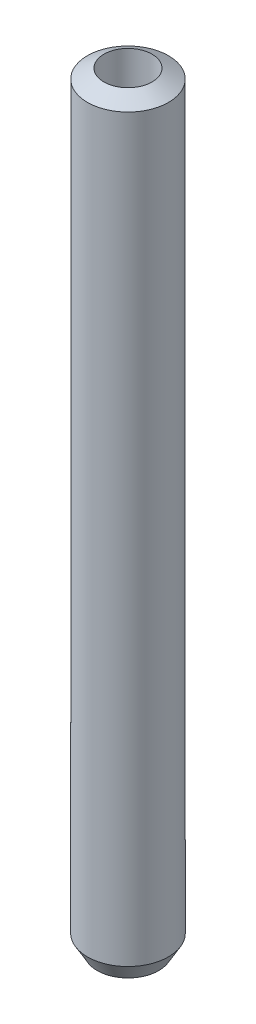
ISO-10303-21;
HEADER;
FILE_DESCRIPTION(('STEP AP214'),'2;1');
FILE_NAME('part.step','',(''),(''),'','','');
FILE_SCHEMA(('AUTOMOTIVE_DESIGN { 1 0 10303 214 1 1 1 1 }'));
ENDSEC;
DATA;
#1=APPLICATION_CONTEXT('core data for automotive mechanical design processes');
#2=APPLICATION_PROTOCOL_DEFINITION('international standard','automotive_design',2000,#1);
#3=PRODUCT_CONTEXT('',#1,'mechanical');
#4=PRODUCT('Part','Part','',(#3));
#5=PRODUCT_RELATED_PRODUCT_CATEGORY('part','',(#4));
#6=PRODUCT_DEFINITION_FORMATION('','',#4);
#7=PRODUCT_DEFINITION_CONTEXT('part definition',#1,'design');
#8=PRODUCT_DEFINITION('design','',#6,#7);
#9=PRODUCT_DEFINITION_SHAPE('','',#8);
#10=(LENGTH_UNIT() NAMED_UNIT(*) SI_UNIT(.MILLI.,.METRE.));
#11=(NAMED_UNIT(*) PLANE_ANGLE_UNIT() SI_UNIT($,.RADIAN.));
#12=(NAMED_UNIT(*) SI_UNIT($,.STERADIAN.) SOLID_ANGLE_UNIT());
#13=UNCERTAINTY_MEASURE_WITH_UNIT(LENGTH_MEASURE(1.E-05),#10,'distance_accuracy_value','');
#14=(GEOMETRIC_REPRESENTATION_CONTEXT(3) GLOBAL_UNCERTAINTY_ASSIGNED_CONTEXT((#13)) GLOBAL_UNIT_ASSIGNED_CONTEXT((#10,
#11,#12)) REPRESENTATION_CONTEXT('',''));
#15=CARTESIAN_POINT('',(0.,0.,0.));
#16=DIRECTION('',(0.,0.,1.));
#17=DIRECTION('',(1.,0.,0.));
#18=AXIS2_PLACEMENT_3D('',#15,#16,#17);
#19=CARTESIAN_POINT('',(0.,141.884383848378,0.));
#20=DIRECTION('',(0.,-1.,0.));
#21=DIRECTION('',(0.,0.,-1.));
#22=AXIS2_PLACEMENT_3D('',#19,#20,#21);
#23=CYLINDRICAL_SURFACE('',#22,7.5);
#24=CARTESIAN_POINT('',(0.,140.093482967697,0.));
#25=DIRECTION('',(0.,1.,0.));
#26=DIRECTION('',(0.,0.,1.));
#27=AXIS2_PLACEMENT_3D('',#24,#25,#26);
#28=CIRCLE('',#27,7.5);
#29=CARTESIAN_POINT('',(0.,140.093482967697,7.5));
#30=VERTEX_POINT('',#29);
#31=EDGE_CURVE('E50',#30,#30,#28,.F.);
#32=ORIENTED_EDGE('',*,*,#31,.T.);
#33=EDGE_LOOP('',(#32));
#34=FACE_BOUND('',#33,.T.);
#35=CARTESIAN_POINT('',(0.,3.1019313166589,0.));
#36=DIRECTION('',(0.,1.,0.));
#37=DIRECTION('',(0.,0.,1.));
#38=AXIS2_PLACEMENT_3D('',#35,#36,#37);
#39=CIRCLE('',#38,7.5);
#40=CARTESIAN_POINT('',(0.,3.1019313166589,7.5));
#41=VERTEX_POINT('',#40);
#42=EDGE_CURVE('E51',#41,#41,#39,.T.);
#43=ORIENTED_EDGE('',*,*,#42,.T.);
#44=EDGE_LOOP('',(#43));
#45=FACE_BOUND('',#44,.T.);
#46=ADVANCED_FACE('F39',(#34,#45),#23,.T.);
#47=CARTESIAN_POINT('',(0.,0.,0.));
#48=DIRECTION('',(0.,1.,0.));
#49=DIRECTION('',(0.,0.,1.));
#50=AXIS2_PLACEMENT_3D('',#47,#48,#49);
#51=PLANE('',#50);
#52=CARTESIAN_POINT('',(0.,0.,0.));
#53=DIRECTION('',(0.,1.,0.));
#54=DIRECTION('',(0.,0.,1.));
#55=AXIS2_PLACEMENT_3D('',#52,#53,#54);
#56=CIRCLE('',#55,5.70909911931923);
#57=CARTESIAN_POINT('',(0.,0.,5.70909911931923));
#58=VERTEX_POINT('',#57);
#59=EDGE_CURVE('E10',#58,#58,#56,.F.);
#60=ORIENTED_EDGE('',*,*,#59,.T.);
#61=EDGE_LOOP('',(#60));
#62=FACE_BOUND('',#61,.T.);
#63=CARTESIAN_POINT('',(0.,0.,0.));
#64=DIRECTION('',(0.,1.,0.));
#65=DIRECTION('',(0.,0.,1.));
#66=AXIS2_PLACEMENT_3D('',#63,#64,#65);
#67=CIRCLE('',#66,4.45957948400407);
#68=CARTESIAN_POINT('',(0.,0.,4.45957948400407));
#69=VERTEX_POINT('',#68);
#70=EDGE_CURVE('E58',#69,#69,#67,.T.);
#71=ORIENTED_EDGE('',*,*,#70,.T.);
#72=EDGE_LOOP('',(#71));
#73=FACE_BOUND('',#72,.T.);
#74=ADVANCED_FACE('F62',(#62,#73),#51,.F.);
#75=CARTESIAN_POINT('',(0.,141.884383848378,0.));
#76=DIRECTION('',(0.,-1.,0.));
#77=DIRECTION('',(0.,0.,-1.));
#78=AXIS2_PLACEMENT_3D('',#75,#76,#77);
#79=CYLINDRICAL_SURFACE('',#78,4.45957948400407);
#80=CARTESIAN_POINT('',(0.,141.848870571057,0.));
#81=DIRECTION('',(0.,-1.,0.));
#82=DIRECTION('',(0.,0.,-1.));
#83=AXIS2_PLACEMENT_3D('',#80,#81,#82);
#84=CIRCLE('',#83,4.45957948400407);
#85=CARTESIAN_POINT('',(0.,141.848870571057,-4.45957948400407));
#86=VERTEX_POINT('',#85);
#87=EDGE_CURVE('E54',#86,#86,#84,.F.);
#88=ORIENTED_EDGE('',*,*,#87,.T.);
#89=EDGE_LOOP('',(#88));
#90=FACE_BOUND('',#89,.T.);
#91=ORIENTED_EDGE('',*,*,#70,.F.);
#92=EDGE_LOOP('',(#91));
#93=FACE_BOUND('',#92,.T.);
#94=ADVANCED_FACE('F68',(#90,#93),#79,.F.);
#95=CARTESIAN_POINT('',(0.,141.884383848378,0.));
#96=DIRECTION('',(0.,-1.,0.));
#97=DIRECTION('',(0.,0.,-1.));
#98=AXIS2_PLACEMENT_3D('',#95,#96,#97);
#99=CONICAL_SURFACE('',#98,4.39806868334114,1.0471975511966);
#100=ORIENTED_EDGE('',*,*,#31,.F.);
#101=EDGE_LOOP('',(#100));
#102=FACE_BOUND('',#101,.T.);
#103=ORIENTED_EDGE('',*,*,#87,.F.);
#104=EDGE_LOOP('',(#103));
#105=FACE_BOUND('',#104,.T.);
#106=ADVANCED_FACE('F66',(#102,#105),#99,.T.);
#107=CARTESIAN_POINT('',(0.,3.1019313166589,0.));
#108=DIRECTION('',(0.,1.,0.));
#109=DIRECTION('',(0.,0.,1.));
#110=AXIS2_PLACEMENT_3D('',#107,#108,#109);
#111=CONICAL_SURFACE('',#110,7.5,0.523598775598305);
#112=ORIENTED_EDGE('',*,*,#59,.F.);
#113=EDGE_LOOP('',(#112));
#114=FACE_BOUND('',#113,.T.);
#115=ORIENTED_EDGE('',*,*,#42,.F.);
#116=EDGE_LOOP('',(#115));
#117=FACE_BOUND('',#116,.T.);
#118=ADVANCED_FACE('F45',(#114,#117),#111,.T.);
#119=CLOSED_SHELL('',(#46,#74,#94,#106,#118));
#120=MANIFOLD_SOLID_BREP('B2',#119);
#121=ADVANCED_BREP_SHAPE_REPRESENTATION('',(#18,#120),#14);
#122=SHAPE_DEFINITION_REPRESENTATION(#9,#121);
ENDSEC;
END-ISO-10303-21;
